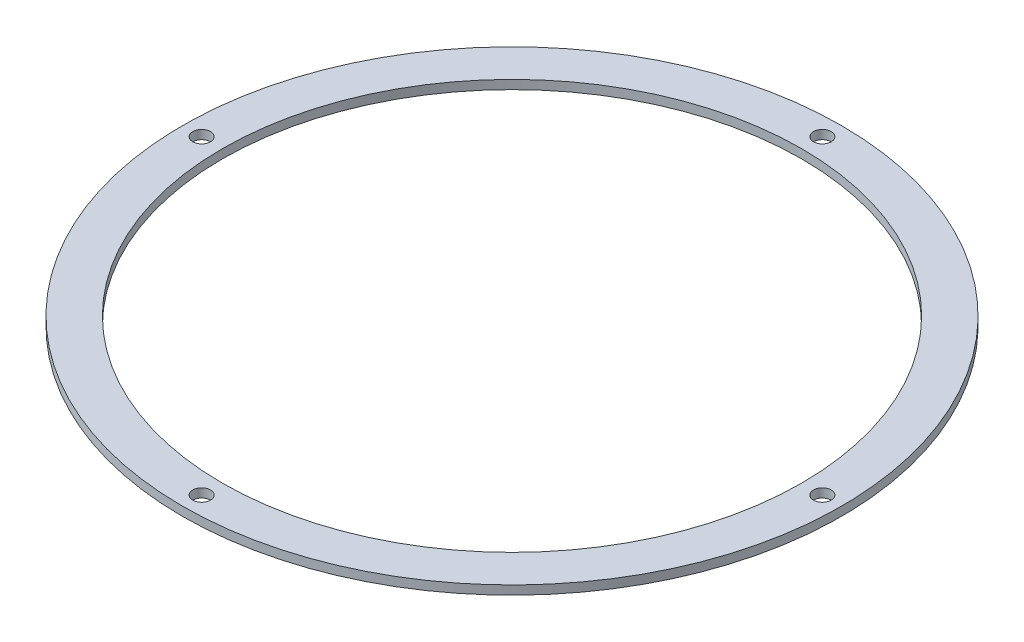
ISO-10303-21;
HEADER;
FILE_DESCRIPTION(('STEP AP214'),'2;1');
FILE_NAME('part.step','',(''),(''),'','','');
FILE_SCHEMA(('AUTOMOTIVE_DESIGN { 1 0 10303 214 1 1 1 1 }'));
ENDSEC;
DATA;
#1=APPLICATION_CONTEXT('core data for automotive mechanical design processes');
#2=APPLICATION_PROTOCOL_DEFINITION('international standard','automotive_design',2000,#1);
#3=PRODUCT_CONTEXT('',#1,'mechanical');
#4=PRODUCT('Part','Part','',(#3));
#5=PRODUCT_RELATED_PRODUCT_CATEGORY('part','',(#4));
#6=PRODUCT_DEFINITION_FORMATION('','',#4);
#7=PRODUCT_DEFINITION_CONTEXT('part definition',#1,'design');
#8=PRODUCT_DEFINITION('design','',#6,#7);
#9=PRODUCT_DEFINITION_SHAPE('','',#8);
#10=(LENGTH_UNIT() NAMED_UNIT(*) SI_UNIT(.MILLI.,.METRE.));
#11=(NAMED_UNIT(*) PLANE_ANGLE_UNIT() SI_UNIT($,.RADIAN.));
#12=(NAMED_UNIT(*) SI_UNIT($,.STERADIAN.) SOLID_ANGLE_UNIT());
#13=UNCERTAINTY_MEASURE_WITH_UNIT(LENGTH_MEASURE(1.E-05),#10,'distance_accuracy_value','');
#14=(GEOMETRIC_REPRESENTATION_CONTEXT(3) GLOBAL_UNCERTAINTY_ASSIGNED_CONTEXT((#13)) GLOBAL_UNIT_ASSIGNED_CONTEXT((#10,
#11,#12)) REPRESENTATION_CONTEXT('',''));
#15=CARTESIAN_POINT('',(0.,0.,0.));
#16=DIRECTION('',(0.,0.,1.));
#17=DIRECTION('',(1.,0.,0.));
#18=AXIS2_PLACEMENT_3D('',#15,#16,#17);
#19=CARTESIAN_POINT('',(0.,3.,0.));
#20=DIRECTION('',(0.,1.,0.));
#21=DIRECTION('',(0.,0.,1.));
#22=AXIS2_PLACEMENT_3D('',#19,#20,#21);
#23=PLANE('',#22);
#24=CARTESIAN_POINT('',(0.,3.,-105.));
#25=DIRECTION('',(0.,1.,0.));
#26=DIRECTION('',(0.,0.,1.));
#27=AXIS2_PLACEMENT_3D('',#24,#25,#26);
#28=CIRCLE('',#27,3.);
#29=CARTESIAN_POINT('',(0.,3.,-102.));
#30=VERTEX_POINT('',#29);
#31=EDGE_CURVE('E74',#30,#30,#28,.T.);
#32=ORIENTED_EDGE('',*,*,#31,.F.);
#33=EDGE_LOOP('',(#32));
#34=FACE_BOUND('',#33,.T.);
#35=CARTESIAN_POINT('',(105.,3.,0.));
#36=DIRECTION('',(0.,1.,0.));
#37=DIRECTION('',(0.,0.,1.));
#38=AXIS2_PLACEMENT_3D('',#35,#36,#37);
#39=CIRCLE('',#38,3.00000000000001);
#40=CARTESIAN_POINT('',(105.,3.,3.00000000000001));
#41=VERTEX_POINT('',#40);
#42=EDGE_CURVE('E72',#41,#41,#39,.T.);
#43=ORIENTED_EDGE('',*,*,#42,.F.);
#44=EDGE_LOOP('',(#43));
#45=FACE_BOUND('',#44,.T.);
#46=CARTESIAN_POINT('',(0.,3.,105.));
#47=DIRECTION('',(0.,1.,0.));
#48=DIRECTION('',(0.,0.,1.));
#49=AXIS2_PLACEMENT_3D('',#46,#47,#48);
#50=CIRCLE('',#49,3.);
#51=CARTESIAN_POINT('',(0.,3.,108.));
#52=VERTEX_POINT('',#51);
#53=EDGE_CURVE('E62',#52,#52,#50,.T.);
#54=ORIENTED_EDGE('',*,*,#53,.F.);
#55=EDGE_LOOP('',(#54));
#56=FACE_BOUND('',#55,.T.);
#57=CARTESIAN_POINT('',(-105.,3.,0.));
#58=DIRECTION('',(0.,1.,0.));
#59=DIRECTION('',(0.,0.,1.));
#60=AXIS2_PLACEMENT_3D('',#57,#58,#59);
#61=CIRCLE('',#60,3.00000000000001);
#62=CARTESIAN_POINT('',(-105.,3.,3.00000000000001));
#63=VERTEX_POINT('',#62);
#64=EDGE_CURVE('E56',#63,#63,#61,.T.);
#65=ORIENTED_EDGE('',*,*,#64,.F.);
#66=EDGE_LOOP('',(#65));
#67=FACE_BOUND('',#66,.T.);
#68=CARTESIAN_POINT('',(0.,3.,0.));
#69=DIRECTION('',(0.,1.,0.));
#70=DIRECTION('',(0.,0.,1.));
#71=AXIS2_PLACEMENT_3D('',#68,#69,#70);
#72=CIRCLE('',#71,111.5);
#73=CARTESIAN_POINT('',(0.,3.,111.5));
#74=VERTEX_POINT('',#73);
#75=EDGE_CURVE('E10',#74,#74,#72,.T.);
#76=ORIENTED_EDGE('',*,*,#75,.T.);
#77=EDGE_LOOP('',(#76));
#78=FACE_BOUND('',#77,.T.);
#79=CARTESIAN_POINT('',(0.,3.,0.));
#80=DIRECTION('',(0.,1.,0.));
#81=DIRECTION('',(0.,0.,1.));
#82=AXIS2_PLACEMENT_3D('',#79,#80,#81);
#83=CIRCLE('',#82,98.);
#84=CARTESIAN_POINT('',(0.,3.,98.));
#85=VERTEX_POINT('',#84);
#86=EDGE_CURVE('E48',#85,#85,#83,.T.);
#87=ORIENTED_EDGE('',*,*,#86,.F.);
#88=EDGE_LOOP('',(#87));
#89=FACE_BOUND('',#88,.T.);
#90=ADVANCED_FACE('F40',(#34,#45,#56,#67,#78,#89),#23,.T.);
#91=CARTESIAN_POINT('',(0.,0.,0.));
#92=DIRECTION('',(0.,1.,0.));
#93=DIRECTION('',(0.,0.,1.));
#94=AXIS2_PLACEMENT_3D('',#91,#92,#93);
#95=PLANE('',#94);
#96=CARTESIAN_POINT('',(0.,0.,-105.));
#97=DIRECTION('',(0.,1.,0.));
#98=DIRECTION('',(0.,0.,1.));
#99=AXIS2_PLACEMENT_3D('',#96,#97,#98);
#100=CIRCLE('',#99,3.);
#101=CARTESIAN_POINT('',(0.,0.,-102.));
#102=VERTEX_POINT('',#101);
#103=EDGE_CURVE('E52',#102,#102,#100,.T.);
#104=ORIENTED_EDGE('',*,*,#103,.T.);
#105=EDGE_LOOP('',(#104));
#106=FACE_BOUND('',#105,.T.);
#107=CARTESIAN_POINT('',(105.,0.,0.));
#108=DIRECTION('',(0.,1.,0.));
#109=DIRECTION('',(0.,0.,1.));
#110=AXIS2_PLACEMENT_3D('',#107,#108,#109);
#111=CIRCLE('',#110,3.00000000000001);
#112=CARTESIAN_POINT('',(105.,0.,3.00000000000001));
#113=VERTEX_POINT('',#112);
#114=EDGE_CURVE('E70',#113,#113,#111,.T.);
#115=ORIENTED_EDGE('',*,*,#114,.T.);
#116=EDGE_LOOP('',(#115));
#117=FACE_BOUND('',#116,.T.);
#118=CARTESIAN_POINT('',(0.,0.,105.));
#119=DIRECTION('',(0.,1.,0.));
#120=DIRECTION('',(0.,0.,1.));
#121=AXIS2_PLACEMENT_3D('',#118,#119,#120);
#122=CIRCLE('',#121,3.);
#123=CARTESIAN_POINT('',(0.,0.,108.));
#124=VERTEX_POINT('',#123);
#125=EDGE_CURVE('E61',#124,#124,#122,.T.);
#126=ORIENTED_EDGE('',*,*,#125,.T.);
#127=EDGE_LOOP('',(#126));
#128=FACE_BOUND('',#127,.T.);
#129=CARTESIAN_POINT('',(-105.,0.,0.));
#130=DIRECTION('',(0.,1.,0.));
#131=DIRECTION('',(0.,0.,1.));
#132=AXIS2_PLACEMENT_3D('',#129,#130,#131);
#133=CIRCLE('',#132,3.00000000000001);
#134=CARTESIAN_POINT('',(-105.,0.,3.00000000000001));
#135=VERTEX_POINT('',#134);
#136=EDGE_CURVE('E57',#135,#135,#133,.T.);
#137=ORIENTED_EDGE('',*,*,#136,.T.);
#138=EDGE_LOOP('',(#137));
#139=FACE_BOUND('',#138,.T.);
#140=CARTESIAN_POINT('',(0.,0.,0.));
#141=DIRECTION('',(0.,1.,0.));
#142=DIRECTION('',(0.,0.,1.));
#143=AXIS2_PLACEMENT_3D('',#140,#141,#142);
#144=CIRCLE('',#143,111.5);
#145=CARTESIAN_POINT('',(0.,0.,111.5));
#146=VERTEX_POINT('',#145);
#147=EDGE_CURVE('E41',#146,#146,#144,.T.);
#148=ORIENTED_EDGE('',*,*,#147,.F.);
#149=EDGE_LOOP('',(#148));
#150=FACE_BOUND('',#149,.T.);
#151=CARTESIAN_POINT('',(0.,0.,0.));
#152=DIRECTION('',(0.,1.,0.));
#153=DIRECTION('',(0.,0.,1.));
#154=AXIS2_PLACEMENT_3D('',#151,#152,#153);
#155=CIRCLE('',#154,98.);
#156=CARTESIAN_POINT('',(0.,0.,98.));
#157=VERTEX_POINT('',#156);
#158=EDGE_CURVE('E49',#157,#157,#155,.T.);
#159=ORIENTED_EDGE('',*,*,#158,.T.);
#160=EDGE_LOOP('',(#159));
#161=FACE_BOUND('',#160,.T.);
#162=ADVANCED_FACE('F77',(#106,#117,#128,#139,#150,#161),#95,.F.);
#163=CARTESIAN_POINT('',(0.,3.,0.));
#164=DIRECTION('',(0.,-1.,0.));
#165=DIRECTION('',(0.,0.,-1.));
#166=AXIS2_PLACEMENT_3D('',#163,#164,#165);
#167=CYLINDRICAL_SURFACE('',#166,111.5);
#168=ORIENTED_EDGE('',*,*,#75,.F.);
#169=EDGE_LOOP('',(#168));
#170=FACE_BOUND('',#169,.T.);
#171=ORIENTED_EDGE('',*,*,#147,.T.);
#172=EDGE_LOOP('',(#171));
#173=FACE_BOUND('',#172,.T.);
#174=ADVANCED_FACE('F39',(#170,#173),#167,.T.);
#175=CARTESIAN_POINT('',(0.,3.,0.));
#176=DIRECTION('',(0.,-1.,0.));
#177=DIRECTION('',(0.,0.,-1.));
#178=AXIS2_PLACEMENT_3D('',#175,#176,#177);
#179=CYLINDRICAL_SURFACE('',#178,98.);
#180=ORIENTED_EDGE('',*,*,#86,.T.);
#181=EDGE_LOOP('',(#180));
#182=FACE_BOUND('',#181,.T.);
#183=ORIENTED_EDGE('',*,*,#158,.F.);
#184=EDGE_LOOP('',(#183));
#185=FACE_BOUND('',#184,.T.);
#186=ADVANCED_FACE('F101',(#182,#185),#179,.F.);
#187=CARTESIAN_POINT('',(-105.,0.,0.));
#188=DIRECTION('',(0.,1.,0.));
#189=DIRECTION('',(0.,0.,1.));
#190=AXIS2_PLACEMENT_3D('',#187,#188,#189);
#191=CYLINDRICAL_SURFACE('',#190,3.00000000000001);
#192=ORIENTED_EDGE('',*,*,#136,.F.);
#193=EDGE_LOOP('',(#192));
#194=FACE_BOUND('',#193,.T.);
#195=ORIENTED_EDGE('',*,*,#64,.T.);
#196=EDGE_LOOP('',(#195));
#197=FACE_BOUND('',#196,.T.);
#198=ADVANCED_FACE('F102',(#194,#197),#191,.F.);
#199=CARTESIAN_POINT('',(0.,0.,105.));
#200=DIRECTION('',(0.,1.,0.));
#201=DIRECTION('',(0.,0.,1.));
#202=AXIS2_PLACEMENT_3D('',#199,#200,#201);
#203=CYLINDRICAL_SURFACE('',#202,3.);
#204=ORIENTED_EDGE('',*,*,#125,.F.);
#205=EDGE_LOOP('',(#204));
#206=FACE_BOUND('',#205,.T.);
#207=ORIENTED_EDGE('',*,*,#53,.T.);
#208=EDGE_LOOP('',(#207));
#209=FACE_BOUND('',#208,.T.);
#210=ADVANCED_FACE('F119',(#206,#209),#203,.F.);
#211=CARTESIAN_POINT('',(105.,0.,0.));
#212=DIRECTION('',(0.,1.,0.));
#213=DIRECTION('',(0.,0.,1.));
#214=AXIS2_PLACEMENT_3D('',#211,#212,#213);
#215=CYLINDRICAL_SURFACE('',#214,3.00000000000001);
#216=ORIENTED_EDGE('',*,*,#114,.F.);
#217=EDGE_LOOP('',(#216));
#218=FACE_BOUND('',#217,.T.);
#219=ORIENTED_EDGE('',*,*,#42,.T.);
#220=EDGE_LOOP('',(#219));
#221=FACE_BOUND('',#220,.T.);
#222=ADVANCED_FACE('F88',(#218,#221),#215,.F.);
#223=CARTESIAN_POINT('',(0.,0.,-105.));
#224=DIRECTION('',(0.,1.,0.));
#225=DIRECTION('',(0.,0.,1.));
#226=AXIS2_PLACEMENT_3D('',#223,#224,#225);
#227=CYLINDRICAL_SURFACE('',#226,3.);
#228=ORIENTED_EDGE('',*,*,#103,.F.);
#229=EDGE_LOOP('',(#228));
#230=FACE_BOUND('',#229,.T.);
#231=ORIENTED_EDGE('',*,*,#31,.T.);
#232=EDGE_LOOP('',(#231));
#233=FACE_BOUND('',#232,.T.);
#234=ADVANCED_FACE('F85',(#230,#233),#227,.F.);
#235=CLOSED_SHELL('',(#90,#162,#174,#186,#198,#210,#222,#234));
#236=MANIFOLD_SOLID_BREP('B2',#235);
#237=ADVANCED_BREP_SHAPE_REPRESENTATION('',(#18,#236),#14);
#238=SHAPE_DEFINITION_REPRESENTATION(#9,#237);
ENDSEC;
END-ISO-10303-21;
